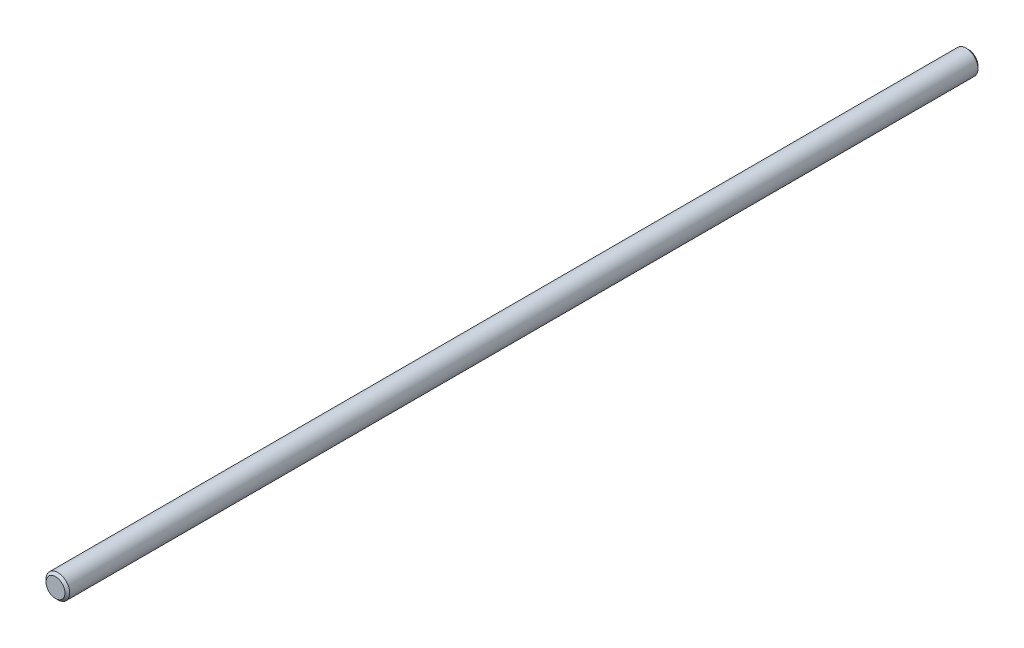
ISO-10303-21;
HEADER;
FILE_DESCRIPTION(('STEP AP214'),'2;1');
FILE_NAME('part.step','',(''),(''),'','','');
FILE_SCHEMA(('AUTOMOTIVE_DESIGN { 1 0 10303 214 1 1 1 1 }'));
ENDSEC;
DATA;
#1=APPLICATION_CONTEXT('core data for automotive mechanical design processes');
#2=APPLICATION_PROTOCOL_DEFINITION('international standard','automotive_design',2000,#1);
#3=PRODUCT_CONTEXT('',#1,'mechanical');
#4=PRODUCT('Part','Part','',(#3));
#5=PRODUCT_RELATED_PRODUCT_CATEGORY('part','',(#4));
#6=PRODUCT_DEFINITION_FORMATION('','',#4);
#7=PRODUCT_DEFINITION_CONTEXT('part definition',#1,'design');
#8=PRODUCT_DEFINITION('design','',#6,#7);
#9=PRODUCT_DEFINITION_SHAPE('','',#8);
#10=(LENGTH_UNIT() NAMED_UNIT(*) SI_UNIT(.MILLI.,.METRE.));
#11=(NAMED_UNIT(*) PLANE_ANGLE_UNIT() SI_UNIT($,.RADIAN.));
#12=(NAMED_UNIT(*) SI_UNIT($,.STERADIAN.) SOLID_ANGLE_UNIT());
#13=UNCERTAINTY_MEASURE_WITH_UNIT(LENGTH_MEASURE(1.E-05),#10,'distance_accuracy_value','');
#14=(GEOMETRIC_REPRESENTATION_CONTEXT(3) GLOBAL_UNCERTAINTY_ASSIGNED_CONTEXT((#13)) GLOBAL_UNIT_ASSIGNED_CONTEXT((#10,
#11,#12)) REPRESENTATION_CONTEXT('',''));
#15=CARTESIAN_POINT('',(0.,0.,0.));
#16=DIRECTION('',(0.,0.,1.));
#17=DIRECTION('',(1.,0.,0.));
#18=AXIS2_PLACEMENT_3D('',#15,#16,#17);
#19=CARTESIAN_POINT('',(0.,0.,122.2375));
#20=DIRECTION('',(0.,0.,-1.));
#21=DIRECTION('',(-1.,0.,0.));
#22=AXIS2_PLACEMENT_3D('',#19,#20,#21);
#23=CYLINDRICAL_SURFACE('',#22,3.175);
#24=CARTESIAN_POINT('',(0.,0.,-121.6025));
#25=DIRECTION('',(0.,0.,1.));
#26=DIRECTION('',(1.,0.,0.));
#27=AXIS2_PLACEMENT_3D('',#24,#25,#26);
#28=CIRCLE('',#27,3.175);
#29=CARTESIAN_POINT('',(3.175,0.,-121.6025));
#30=VERTEX_POINT('',#29);
#31=EDGE_CURVE('E44',#30,#30,#28,.T.);
#32=ORIENTED_EDGE('',*,*,#31,.T.);
#33=EDGE_LOOP('',(#32));
#34=FACE_BOUND('',#33,.T.);
#35=CARTESIAN_POINT('',(0.,0.,121.6025));
#36=DIRECTION('',(0.,0.,1.));
#37=DIRECTION('',(1.,0.,0.));
#38=AXIS2_PLACEMENT_3D('',#35,#36,#37);
#39=CIRCLE('',#38,3.175);
#40=CARTESIAN_POINT('',(3.175,0.,121.6025));
#41=VERTEX_POINT('',#40);
#42=EDGE_CURVE('E48',#41,#41,#39,.F.);
#43=ORIENTED_EDGE('',*,*,#42,.T.);
#44=EDGE_LOOP('',(#43));
#45=FACE_BOUND('',#44,.T.);
#46=ADVANCED_FACE('F33',(#34,#45),#23,.T.);
#47=CARTESIAN_POINT('',(0.,0.,122.2375));
#48=DIRECTION('',(0.,0.,1.));
#49=DIRECTION('',(1.,0.,0.));
#50=AXIS2_PLACEMENT_3D('',#47,#48,#49);
#51=PLANE('',#50);
#52=CARTESIAN_POINT('',(0.,0.,122.2375));
#53=DIRECTION('',(0.,0.,1.));
#54=DIRECTION('',(1.,0.,0.));
#55=AXIS2_PLACEMENT_3D('',#52,#53,#54);
#56=CIRCLE('',#55,2.54000000000001);
#57=CARTESIAN_POINT('',(2.54000000000001,0.,122.2375));
#58=VERTEX_POINT('',#57);
#59=EDGE_CURVE('E10',#58,#58,#56,.T.);
#60=ORIENTED_EDGE('',*,*,#59,.T.);
#61=EDGE_LOOP('',(#60));
#62=FACE_BOUND('',#61,.T.);
#63=ADVANCED_FACE('F64',(#62),#51,.T.);
#64=CARTESIAN_POINT('',(0.,0.,-122.2375));
#65=DIRECTION('',(0.,0.,1.));
#66=DIRECTION('',(1.,0.,0.));
#67=AXIS2_PLACEMENT_3D('',#64,#65,#66);
#68=PLANE('',#67);
#69=CARTESIAN_POINT('',(0.,0.,-122.2375));
#70=DIRECTION('',(0.,0.,1.));
#71=DIRECTION('',(1.,0.,0.));
#72=AXIS2_PLACEMENT_3D('',#69,#70,#71);
#73=CIRCLE('',#72,2.53999999999999);
#74=CARTESIAN_POINT('',(2.53999999999999,0.,-122.2375));
#75=VERTEX_POINT('',#74);
#76=EDGE_CURVE('E40',#75,#75,#73,.F.);
#77=ORIENTED_EDGE('',*,*,#76,.T.);
#78=EDGE_LOOP('',(#77));
#79=FACE_BOUND('',#78,.T.);
#80=ADVANCED_FACE('F61',(#79),#68,.F.);
#81=CARTESIAN_POINT('',(0.,0.,-121.6025));
#82=DIRECTION('',(0.,0.,1.));
#83=DIRECTION('',(1.,0.,0.));
#84=AXIS2_PLACEMENT_3D('',#81,#82,#83);
#85=CONICAL_SURFACE('',#84,3.175,0.785398163397461);
#86=ORIENTED_EDGE('',*,*,#76,.F.);
#87=EDGE_LOOP('',(#86));
#88=FACE_BOUND('',#87,.T.);
#89=ORIENTED_EDGE('',*,*,#31,.F.);
#90=EDGE_LOOP('',(#89));
#91=FACE_BOUND('',#90,.T.);
#92=ADVANCED_FACE('F57',(#88,#91),#85,.T.);
#93=CARTESIAN_POINT('',(0.,0.,122.2375));
#94=DIRECTION('',(0.,0.,-1.));
#95=DIRECTION('',(-1.,0.,0.));
#96=AXIS2_PLACEMENT_3D('',#93,#94,#95);
#97=CONICAL_SURFACE('',#96,2.54000000000001,0.785398163397439);
#98=ORIENTED_EDGE('',*,*,#42,.F.);
#99=EDGE_LOOP('',(#98));
#100=FACE_BOUND('',#99,.T.);
#101=ORIENTED_EDGE('',*,*,#59,.F.);
#102=EDGE_LOOP('',(#101));
#103=FACE_BOUND('',#102,.T.);
#104=ADVANCED_FACE('F35',(#100,#103),#97,.T.);
#105=CLOSED_SHELL('',(#46,#63,#80,#92,#104));
#106=MANIFOLD_SOLID_BREP('B2',#105);
#107=ADVANCED_BREP_SHAPE_REPRESENTATION('',(#18,#106),#14);
#108=SHAPE_DEFINITION_REPRESENTATION(#9,#107);
ENDSEC;
END-ISO-10303-21;
